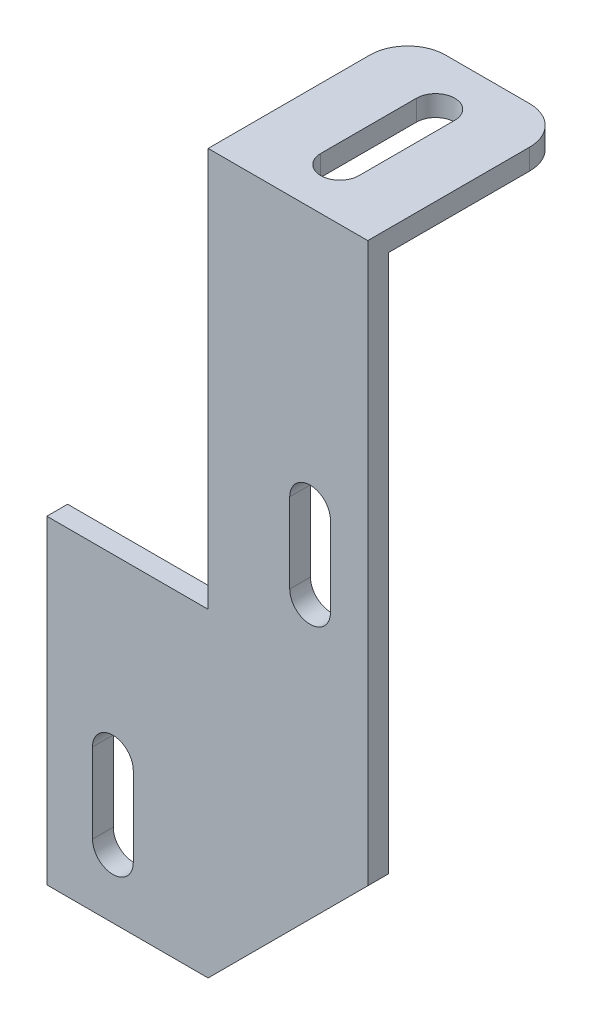
ISO-10303-21;
HEADER;
FILE_DESCRIPTION(('STEP AP214'),'2;1');
FILE_NAME('part.step','',(''),(''),'','','');
FILE_SCHEMA(('AUTOMOTIVE_DESIGN { 1 0 10303 214 1 1 1 1 }'));
ENDSEC;
DATA;
#1=APPLICATION_CONTEXT('core data for automotive mechanical design processes');
#2=APPLICATION_PROTOCOL_DEFINITION('international standard','automotive_design',2000,#1);
#3=PRODUCT_CONTEXT('',#1,'mechanical');
#4=PRODUCT('Part','Part','',(#3));
#5=PRODUCT_RELATED_PRODUCT_CATEGORY('part','',(#4));
#6=PRODUCT_DEFINITION_FORMATION('','',#4);
#7=PRODUCT_DEFINITION_CONTEXT('part definition',#1,'design');
#8=PRODUCT_DEFINITION('design','',#6,#7);
#9=PRODUCT_DEFINITION_SHAPE('','',#8);
#10=(LENGTH_UNIT() NAMED_UNIT(*) SI_UNIT(.MILLI.,.METRE.));
#11=(NAMED_UNIT(*) PLANE_ANGLE_UNIT() SI_UNIT($,.RADIAN.));
#12=(NAMED_UNIT(*) SI_UNIT($,.STERADIAN.) SOLID_ANGLE_UNIT());
#13=UNCERTAINTY_MEASURE_WITH_UNIT(LENGTH_MEASURE(1.E-05),#10,'distance_accuracy_value','');
#14=(GEOMETRIC_REPRESENTATION_CONTEXT(3) GLOBAL_UNCERTAINTY_ASSIGNED_CONTEXT((#13)) GLOBAL_UNIT_ASSIGNED_CONTEXT((#10,
#11,#12)) REPRESENTATION_CONTEXT('',''));
#15=CARTESIAN_POINT('',(0.,0.,0.));
#16=DIRECTION('',(0.,0.,1.));
#17=DIRECTION('',(1.,0.,0.));
#18=AXIS2_PLACEMENT_3D('',#15,#16,#17);
#19=CARTESIAN_POINT('',(186.43752043594,388.239,-24.9210704167667));
#20=DIRECTION('',(0.,1.,0.));
#21=DIRECTION('',(0.,0.,1.));
#22=AXIS2_PLACEMENT_3D('',#19,#20,#21);
#23=CYLINDRICAL_SURFACE('',#22,3.);
#24=CARTESIAN_POINT('',(186.43752043594,389.89,-24.9210704167667));
#25=DIRECTION('',(0.,1.,0.));
#26=DIRECTION('',(0.,0.,1.));
#27=AXIS2_PLACEMENT_3D('',#24,#25,#26);
#28=CIRCLE('',#27,3.);
#29=CARTESIAN_POINT('',(183.43752043594,389.89,-24.9210704167667));
#30=VERTEX_POINT('',#29);
#31=CARTESIAN_POINT('',(186.43752043594,389.89,-27.9210704167667));
#32=VERTEX_POINT('',#31);
#33=EDGE_CURVE('E345',#30,#32,#28,.F.);
#34=ORIENTED_EDGE('',*,*,#33,.T.);
#35=DIRECTION('',(0.,1.,0.));
#36=VECTOR('',#35,1.);
#37=CARTESIAN_POINT('',(186.43752043594,388.239,-27.9210704167667));
#38=LINE('',#37,#36);
#39=CARTESIAN_POINT('',(186.43752043594,388.239,-27.9210704167667));
#40=VERTEX_POINT('',#39);
#41=EDGE_CURVE('E250',#32,#40,#38,.F.);
#42=ORIENTED_EDGE('',*,*,#41,.T.);
#43=CARTESIAN_POINT('',(186.43752043594,388.239,-24.9210704167667));
#44=DIRECTION('',(0.,1.,0.));
#45=DIRECTION('',(0.,0.,1.));
#46=AXIS2_PLACEMENT_3D('',#43,#44,#45);
#47=CIRCLE('',#46,3.);
#48=CARTESIAN_POINT('',(183.43752043594,388.239,-24.9210704167667));
#49=VERTEX_POINT('',#48);
#50=EDGE_CURVE('E231',#49,#40,#47,.F.);
#51=ORIENTED_EDGE('',*,*,#50,.F.);
#52=DIRECTION('',(0.,1.,0.));
#53=VECTOR('',#52,1.);
#54=CARTESIAN_POINT('',(183.43752043594,388.239,-24.9210704167667));
#55=LINE('',#54,#53);
#56=EDGE_CURVE('E253',#49,#30,#55,.T.);
#57=ORIENTED_EDGE('',*,*,#56,.T.);
#58=EDGE_LOOP('',(#34,#42,#51,#57));
#59=FACE_BOUND('',#58,.T.);
#60=ADVANCED_FACE('F18',(#59),#23,.T.);
#61=CARTESIAN_POINT('',(196.13752043594,388.239,-27.9210704167667));
#62=DIRECTION('',(0.,0.,1.));
#63=DIRECTION('',(1.,0.,0.));
#64=AXIS2_PLACEMENT_3D('',#61,#62,#63);
#65=PLANE('',#64);
#66=DIRECTION('',(0.,1.,0.));
#67=VECTOR('',#66,1.);
#68=CARTESIAN_POINT('',(193.13752043594,388.239,-27.9210704167667));
#69=LINE('',#68,#67);
#70=CARTESIAN_POINT('',(193.13752043594,388.239,-27.9210704167667));
#71=VERTEX_POINT('',#70);
#72=CARTESIAN_POINT('',(193.13752043594,389.89,-27.9210704167667));
#73=VERTEX_POINT('',#72);
#74=EDGE_CURVE('E248',#71,#73,#69,.T.);
#75=ORIENTED_EDGE('',*,*,#74,.F.);
#76=DIRECTION('',(1.,0.,0.));
#77=VECTOR('',#76,1.);
#78=CARTESIAN_POINT('',(0.,388.239,-27.9210704167667));
#79=LINE('',#78,#77);
#80=EDGE_CURVE('E195',#40,#71,#79,.T.);
#81=ORIENTED_EDGE('',*,*,#80,.F.);
#82=ORIENTED_EDGE('',*,*,#41,.F.);
#83=DIRECTION('',(1.,0.,0.));
#84=VECTOR('',#83,1.);
#85=CARTESIAN_POINT('',(0.,389.89,-27.9210704167667));
#86=LINE('',#85,#84);
#87=EDGE_CURVE('E344',#32,#73,#86,.T.);
#88=ORIENTED_EDGE('',*,*,#87,.T.);
#89=EDGE_LOOP('',(#75,#81,#82,#88));
#90=FACE_BOUND('',#89,.T.);
#91=ADVANCED_FACE('F366',(#90),#65,.F.);
#92=CARTESIAN_POINT('',(193.13752043594,388.239,-24.9210704167667));
#93=DIRECTION('',(0.,1.,0.));
#94=DIRECTION('',(0.,0.,1.));
#95=AXIS2_PLACEMENT_3D('',#92,#93,#94);
#96=CYLINDRICAL_SURFACE('',#95,3.);
#97=CARTESIAN_POINT('',(193.13752043594,389.89,-24.9210704167667));
#98=DIRECTION('',(0.,1.,0.));
#99=DIRECTION('',(0.,0.,1.));
#100=AXIS2_PLACEMENT_3D('',#97,#98,#99);
#101=CIRCLE('',#100,3.);
#102=CARTESIAN_POINT('',(196.13752043594,389.89,-24.9210704167667));
#103=VERTEX_POINT('',#102);
#104=EDGE_CURVE('E341',#73,#103,#101,.F.);
#105=ORIENTED_EDGE('',*,*,#104,.T.);
#106=DIRECTION('',(0.,1.,0.));
#107=VECTOR('',#106,1.);
#108=CARTESIAN_POINT('',(196.13752043594,388.239,-24.9210704167667));
#109=LINE('',#108,#107);
#110=CARTESIAN_POINT('',(196.13752043594,388.239,-24.9210704167667));
#111=VERTEX_POINT('',#110);
#112=EDGE_CURVE('E188',#103,#111,#109,.F.);
#113=ORIENTED_EDGE('',*,*,#112,.T.);
#114=CARTESIAN_POINT('',(193.13752043594,388.239,-24.9210704167667));
#115=DIRECTION('',(0.,1.,0.));
#116=DIRECTION('',(0.,0.,1.));
#117=AXIS2_PLACEMENT_3D('',#114,#115,#116);
#118=CIRCLE('',#117,3.);
#119=EDGE_CURVE('E357',#71,#111,#118,.F.);
#120=ORIENTED_EDGE('',*,*,#119,.F.);
#121=ORIENTED_EDGE('',*,*,#74,.T.);
#122=EDGE_LOOP('',(#105,#113,#120,#121));
#123=FACE_BOUND('',#122,.T.);
#124=ADVANCED_FACE('F370',(#123),#96,.T.);
#125=CARTESIAN_POINT('',(189.78752043594,394.97,-16.1735704167667));
#126=DIRECTION('',(0.,-1.,0.));
#127=DIRECTION('',(0.,0.,-1.));
#128=AXIS2_PLACEMENT_3D('',#125,#126,#127);
#129=CYLINDRICAL_SURFACE('',#128,1.524);
#130=CARTESIAN_POINT('',(189.78752043594,388.239,-16.1735704167667));
#131=DIRECTION('',(0.,-1.,0.));
#132=DIRECTION('',(0.,0.,-1.));
#133=AXIS2_PLACEMENT_3D('',#130,#131,#132);
#134=CIRCLE('',#133,1.524);
#135=CARTESIAN_POINT('',(188.26352043594,388.239,-16.1735704167667));
#136=VERTEX_POINT('',#135);
#137=CARTESIAN_POINT('',(191.31152043594,388.239,-16.1735704167667));
#138=VERTEX_POINT('',#137);
#139=EDGE_CURVE('E21',#136,#138,#134,.F.);
#140=ORIENTED_EDGE('',*,*,#139,.F.);
#141=DIRECTION('',(0.,1.,0.));
#142=VECTOR('',#141,1.);
#143=CARTESIAN_POINT('',(188.26352043594,394.97,-16.1735704167667));
#144=LINE('',#143,#142);
#145=CARTESIAN_POINT('',(188.26352043594,389.89,-16.1735704167667));
#146=VERTEX_POINT('',#145);
#147=EDGE_CURVE('E200',#136,#146,#144,.T.);
#148=ORIENTED_EDGE('',*,*,#147,.T.);
#149=CARTESIAN_POINT('',(189.78752043594,389.89,-16.1735704167667));
#150=DIRECTION('',(0.,-1.,0.));
#151=DIRECTION('',(0.,0.,-1.));
#152=AXIS2_PLACEMENT_3D('',#149,#150,#151);
#153=CIRCLE('',#152,1.524);
#154=CARTESIAN_POINT('',(191.31152043594,389.89,-16.1735704167667));
#155=VERTEX_POINT('',#154);
#156=EDGE_CURVE('E183',#146,#155,#153,.F.);
#157=ORIENTED_EDGE('',*,*,#156,.T.);
#158=DIRECTION('',(0.,1.,0.));
#159=VECTOR('',#158,1.);
#160=CARTESIAN_POINT('',(191.31152043594,394.97,-16.1735704167667));
#161=LINE('',#160,#159);
#162=EDGE_CURVE('E181',#155,#138,#161,.F.);
#163=ORIENTED_EDGE('',*,*,#162,.T.);
#164=EDGE_LOOP('',(#140,#148,#157,#163));
#165=FACE_BOUND('',#164,.T.);
#166=ADVANCED_FACE('F182',(#165),#129,.F.);
#167=CARTESIAN_POINT('',(191.31152043594,394.97,-23.7935704167667));
#168=DIRECTION('',(1.,0.,0.));
#169=DIRECTION('',(0.,0.,-1.));
#170=AXIS2_PLACEMENT_3D('',#167,#168,#169);
#171=PLANE('',#170);
#172=DIRECTION('',(0.,0.,-1.));
#173=VECTOR('',#172,1.);
#174=CARTESIAN_POINT('',(191.31152043594,388.239,0.));
#175=LINE('',#174,#173);
#176=CARTESIAN_POINT('',(191.31152043594,388.239,-23.7935704167667));
#177=VERTEX_POINT('',#176);
#178=EDGE_CURVE('E174',#138,#177,#175,.T.);
#179=ORIENTED_EDGE('',*,*,#178,.F.);
#180=ORIENTED_EDGE('',*,*,#162,.F.);
#181=DIRECTION('',(0.,0.,-1.));
#182=VECTOR('',#181,1.);
#183=CARTESIAN_POINT('',(191.31152043594,389.89,0.));
#184=LINE('',#183,#182);
#185=CARTESIAN_POINT('',(191.31152043594,389.89,-23.7935704167667));
#186=VERTEX_POINT('',#185);
#187=EDGE_CURVE('E339',#155,#186,#184,.T.);
#188=ORIENTED_EDGE('',*,*,#187,.T.);
#189=DIRECTION('',(0.,-1.,0.));
#190=VECTOR('',#189,1.);
#191=CARTESIAN_POINT('',(191.31152043594,394.97,-23.7935704167667));
#192=LINE('',#191,#190);
#193=EDGE_CURVE('E187',#186,#177,#192,.T.);
#194=ORIENTED_EDGE('',*,*,#193,.T.);
#195=EDGE_LOOP('',(#179,#180,#188,#194));
#196=FACE_BOUND('',#195,.T.);
#197=ADVANCED_FACE('F190',(#196),#171,.F.);
#198=CARTESIAN_POINT('',(189.78752043594,394.97,-23.7935704167667));
#199=DIRECTION('',(0.,-1.,0.));
#200=DIRECTION('',(0.,0.,-1.));
#201=AXIS2_PLACEMENT_3D('',#198,#199,#200);
#202=CYLINDRICAL_SURFACE('',#201,1.524);
#203=CARTESIAN_POINT('',(189.78752043594,389.89,-23.7935704167667));
#204=DIRECTION('',(0.,-1.,0.));
#205=DIRECTION('',(0.,0.,-1.));
#206=AXIS2_PLACEMENT_3D('',#203,#204,#205);
#207=CIRCLE('',#206,1.524);
#208=CARTESIAN_POINT('',(188.26352043594,389.89,-23.7935704167667));
#209=VERTEX_POINT('',#208);
#210=EDGE_CURVE('E336',#186,#209,#207,.F.);
#211=ORIENTED_EDGE('',*,*,#210,.T.);
#212=DIRECTION('',(0.,1.,0.));
#213=VECTOR('',#212,1.);
#214=CARTESIAN_POINT('',(188.26352043594,394.97,-23.7935704167667));
#215=LINE('',#214,#213);
#216=CARTESIAN_POINT('',(188.26352043594,388.239,-23.7935704167667));
#217=VERTEX_POINT('',#216);
#218=EDGE_CURVE('E243',#209,#217,#215,.F.);
#219=ORIENTED_EDGE('',*,*,#218,.T.);
#220=CARTESIAN_POINT('',(189.78752043594,388.239,-23.7935704167667));
#221=DIRECTION('',(0.,-1.,0.));
#222=DIRECTION('',(0.,0.,-1.));
#223=AXIS2_PLACEMENT_3D('',#220,#221,#222);
#224=CIRCLE('',#223,1.524);
#225=EDGE_CURVE('E193',#177,#217,#224,.F.);
#226=ORIENTED_EDGE('',*,*,#225,.F.);
#227=ORIENTED_EDGE('',*,*,#193,.F.);
#228=EDGE_LOOP('',(#211,#219,#226,#227));
#229=FACE_BOUND('',#228,.T.);
#230=ADVANCED_FACE('F439',(#229),#202,.F.);
#231=CARTESIAN_POINT('',(188.26352043594,394.97,-23.7935704167667));
#232=DIRECTION('',(-1.,0.,0.));
#233=DIRECTION('',(0.,0.,1.));
#234=AXIS2_PLACEMENT_3D('',#231,#232,#233);
#235=PLANE('',#234);
#236=DIRECTION('',(0.,0.,-1.));
#237=VECTOR('',#236,1.);
#238=CARTESIAN_POINT('',(188.26352043594,388.239,0.));
#239=LINE('',#238,#237);
#240=EDGE_CURVE('E177',#217,#136,#239,.F.);
#241=ORIENTED_EDGE('',*,*,#240,.F.);
#242=ORIENTED_EDGE('',*,*,#218,.F.);
#243=DIRECTION('',(0.,0.,-1.));
#244=VECTOR('',#243,1.);
#245=CARTESIAN_POINT('',(188.26352043594,389.89,0.));
#246=LINE('',#245,#244);
#247=EDGE_CURVE('E210',#209,#146,#246,.F.);
#248=ORIENTED_EDGE('',*,*,#247,.T.);
#249=ORIENTED_EDGE('',*,*,#147,.F.);
#250=EDGE_LOOP('',(#241,#242,#248,#249));
#251=FACE_BOUND('',#250,.T.);
#252=ADVANCED_FACE('F441',(#251),#235,.F.);
#253=CARTESIAN_POINT('',(0.,388.239,0.));
#254=DIRECTION('',(0.,-1.,0.));
#255=DIRECTION('',(0.,0.,-1.));
#256=AXIS2_PLACEMENT_3D('',#253,#254,#255);
#257=PLANE('',#256);
#258=DIRECTION('',(0.,0.,-1.));
#259=VECTOR('',#258,1.);
#260=CARTESIAN_POINT('',(183.43752043594,388.239,-27.9210704167667));
#261=LINE('',#260,#259);
#262=CARTESIAN_POINT('',(183.43752043594,388.239,-13.6970704167667));
#263=VERTEX_POINT('',#262);
#264=EDGE_CURVE('E256',#263,#49,#261,.T.);
#265=ORIENTED_EDGE('',*,*,#264,.T.);
#266=ORIENTED_EDGE('',*,*,#50,.T.);
#267=ORIENTED_EDGE('',*,*,#80,.T.);
#268=ORIENTED_EDGE('',*,*,#119,.T.);
#269=DIRECTION('',(0.,0.,1.));
#270=VECTOR('',#269,1.);
#271=CARTESIAN_POINT('',(196.13752043594,388.239,-27.9210704167667));
#272=LINE('',#271,#270);
#273=CARTESIAN_POINT('',(196.13752043594,388.239,-13.6970704167667));
#274=VERTEX_POINT('',#273);
#275=EDGE_CURVE('E201',#111,#274,#272,.T.);
#276=ORIENTED_EDGE('',*,*,#275,.T.);
#277=DIRECTION('',(1.,0.,0.));
#278=VECTOR('',#277,1.);
#279=CARTESIAN_POINT('',(0.,388.239,-13.6970704167667));
#280=LINE('',#279,#278);
#281=EDGE_CURVE('E228',#274,#263,#280,.F.);
#282=ORIENTED_EDGE('',*,*,#281,.T.);
#283=EDGE_LOOP('',(#265,#266,#267,#268,#276,#282));
#284=FACE_BOUND('',#283,.T.);
#285=ORIENTED_EDGE('',*,*,#178,.T.);
#286=ORIENTED_EDGE('',*,*,#225,.T.);
#287=ORIENTED_EDGE('',*,*,#240,.T.);
#288=ORIENTED_EDGE('',*,*,#139,.T.);
#289=EDGE_LOOP('',(#285,#286,#287,#288));
#290=FACE_BOUND('',#289,.T.);
#291=ADVANCED_FACE('F171',(#284,#290),#257,.T.);
#292=CARTESIAN_POINT('',(0.,0.,-13.6970704167667));
#293=DIRECTION('',(0.,0.,1.));
#294=DIRECTION('',(1.,0.,0.));
#295=AXIS2_PLACEMENT_3D('',#292,#293,#294);
#296=PLANE('',#295);
#297=DIRECTION('',(-0.707106781186546,-0.707106781186549,0.));
#298=VECTOR('',#297,1.);
#299=CARTESIAN_POINT('',(183.43752043594,332.74,-13.6970704167667));
#300=LINE('',#299,#298);
#301=CARTESIAN_POINT('',(196.13752043594,345.44,-13.6970704167667));
#302=VERTEX_POINT('',#301);
#303=CARTESIAN_POINT('',(183.43752043594,332.74,-13.6970704167667));
#304=VERTEX_POINT('',#303);
#305=EDGE_CURVE('E234',#302,#304,#300,.T.);
#306=ORIENTED_EDGE('',*,*,#305,.T.);
#307=DIRECTION('',(1.,0.,0.));
#308=VECTOR('',#307,1.);
#309=CARTESIAN_POINT('',(183.43752043594,332.74,-13.6970704167667));
#310=LINE('',#309,#308);
#311=CARTESIAN_POINT('',(170.61052043594,332.74,-13.6970704167667));
#312=VERTEX_POINT('',#311);
#313=EDGE_CURVE('E298',#304,#312,#310,.F.);
#314=ORIENTED_EDGE('',*,*,#313,.T.);
#315=DIRECTION('',(0.,1.,0.));
#316=VECTOR('',#315,1.);
#317=CARTESIAN_POINT('',(170.61052043594,332.74,-13.6970704167667));
#318=LINE('',#317,#316);
#319=CARTESIAN_POINT('',(170.61052043594,358.14,-13.6970704167667));
#320=VERTEX_POINT('',#319);
#321=EDGE_CURVE('E279',#320,#312,#318,.F.);
#322=ORIENTED_EDGE('',*,*,#321,.F.);
#323=DIRECTION('',(1.,0.,0.));
#324=VECTOR('',#323,1.);
#325=CARTESIAN_POINT('',(183.43752043594,358.14,-13.6970704167667));
#326=LINE('',#325,#324);
#327=CARTESIAN_POINT('',(183.43752043594,358.14,-13.6970704167667));
#328=VERTEX_POINT('',#327);
#329=EDGE_CURVE('E277',#328,#320,#326,.F.);
#330=ORIENTED_EDGE('',*,*,#329,.F.);
#331=DIRECTION('',(0.,1.,0.));
#332=VECTOR('',#331,1.);
#333=CARTESIAN_POINT('',(183.43752043594,388.239,-13.6970704167667));
#334=LINE('',#333,#332);
#335=EDGE_CURVE('E264',#328,#263,#334,.T.);
#336=ORIENTED_EDGE('',*,*,#335,.T.);
#337=ORIENTED_EDGE('',*,*,#281,.F.);
#338=DIRECTION('',(0.,1.,0.));
#339=VECTOR('',#338,1.);
#340=CARTESIAN_POINT('',(196.13752043594,388.239,-13.6970704167667));
#341=LINE('',#340,#339);
#342=EDGE_CURVE('E208',#274,#302,#341,.F.);
#343=ORIENTED_EDGE('',*,*,#342,.T.);
#344=EDGE_LOOP('',(#306,#314,#322,#330,#336,#337,#343));
#345=FACE_BOUND('',#344,.T.);
#346=CARTESIAN_POINT('',(191.550250383083,369.134894710635,-13.6970704167667));
#347=DIRECTION('',(0.,0.,-1.));
#348=DIRECTION('',(-1.,0.,0.));
#349=AXIS2_PLACEMENT_3D('',#346,#347,#348);
#350=CIRCLE('',#349,1.62099013813655);
#351=CARTESIAN_POINT('',(193.17124052122,369.134894710635,-13.6970704167667));
#352=VERTEX_POINT('',#351);
#353=CARTESIAN_POINT('',(189.929260244947,369.134894710635,-13.6970704167667));
#354=VERTEX_POINT('',#353);
#355=EDGE_CURVE('E348',#352,#354,#350,.F.);
#356=ORIENTED_EDGE('',*,*,#355,.T.);
#357=DIRECTION('',(0.,1.,0.));
#358=VECTOR('',#357,1.);
#359=CARTESIAN_POINT('',(189.929260244947,369.134894710635,-13.6970704167667));
#360=LINE('',#359,#358);
#361=CARTESIAN_POINT('',(189.929260244947,362.784894710635,-13.6970704167667));
#362=VERTEX_POINT('',#361);
#363=EDGE_CURVE('E304',#354,#362,#360,.F.);
#364=ORIENTED_EDGE('',*,*,#363,.T.);
#365=CARTESIAN_POINT('',(191.550250383083,362.784894710635,-13.6970704167667));
#366=DIRECTION('',(0.,0.,-1.));
#367=DIRECTION('',(-1.,0.,0.));
#368=AXIS2_PLACEMENT_3D('',#365,#366,#367);
#369=CIRCLE('',#368,1.62099013813655);
#370=CARTESIAN_POINT('',(193.17124052122,362.784894710635,-13.6970704167667));
#371=VERTEX_POINT('',#370);
#372=EDGE_CURVE('E350',#362,#371,#369,.F.);
#373=ORIENTED_EDGE('',*,*,#372,.T.);
#374=DIRECTION('',(0.,1.,0.));
#375=VECTOR('',#374,1.);
#376=CARTESIAN_POINT('',(193.17124052122,369.134894710635,-13.6970704167667));
#377=LINE('',#376,#375);
#378=EDGE_CURVE('E308',#371,#352,#377,.T.);
#379=ORIENTED_EDGE('',*,*,#378,.T.);
#380=EDGE_LOOP('',(#356,#364,#373,#379));
#381=FACE_BOUND('',#380,.T.);
#382=CARTESIAN_POINT('',(175.863160430472,344.058028591819,-13.6970704167667));
#383=DIRECTION('',(0.,0.,-1.));
#384=DIRECTION('',(-1.,0.,0.));
#385=AXIS2_PLACEMENT_3D('',#382,#383,#384);
#386=CIRCLE('',#385,1.62099013813657);
#387=CARTESIAN_POINT('',(177.484150568608,344.058028591819,-13.6970704167667));
#388=VERTEX_POINT('',#387);
#389=CARTESIAN_POINT('',(174.242170292335,344.058028591819,-13.6970704167667));
#390=VERTEX_POINT('',#389);
#391=EDGE_CURVE('E352',#388,#390,#386,.F.);
#392=ORIENTED_EDGE('',*,*,#391,.T.);
#393=DIRECTION('',(0.,1.,0.));
#394=VECTOR('',#393,1.);
#395=CARTESIAN_POINT('',(174.242170292335,344.058028591819,-13.6970704167667));
#396=LINE('',#395,#394);
#397=CARTESIAN_POINT('',(174.242170292335,337.708028591819,-13.6970704167667));
#398=VERTEX_POINT('',#397);
#399=EDGE_CURVE('E312',#390,#398,#396,.F.);
#400=ORIENTED_EDGE('',*,*,#399,.T.);
#401=CARTESIAN_POINT('',(175.863160430472,337.708028591819,-13.6970704167667));
#402=DIRECTION('',(0.,0.,-1.));
#403=DIRECTION('',(-1.,0.,0.));
#404=AXIS2_PLACEMENT_3D('',#401,#402,#403);
#405=CIRCLE('',#404,1.62099013813657);
#406=CARTESIAN_POINT('',(177.484150568608,337.708028591819,-13.6970704167667));
#407=VERTEX_POINT('',#406);
#408=EDGE_CURVE('E230',#398,#407,#405,.F.);
#409=ORIENTED_EDGE('',*,*,#408,.T.);
#410=DIRECTION('',(0.,1.,0.));
#411=VECTOR('',#410,1.);
#412=CARTESIAN_POINT('',(177.484150568608,344.058028591819,-13.6970704167667));
#413=LINE('',#412,#411);
#414=EDGE_CURVE('E317',#407,#388,#413,.T.);
#415=ORIENTED_EDGE('',*,*,#414,.T.);
#416=EDGE_LOOP('',(#392,#400,#409,#415));
#417=FACE_BOUND('',#416,.T.);
#418=ADVANCED_FACE('F382',(#345,#381,#417),#296,.F.);
#419=CARTESIAN_POINT('',(175.863160430472,337.708028591819,2.65292958323325));
#420=DIRECTION('',(0.,0.,-1.));
#421=DIRECTION('',(-1.,0.,0.));
#422=AXIS2_PLACEMENT_3D('',#419,#420,#421);
#423=CYLINDRICAL_SURFACE('',#422,1.62099013813657);
#424=ORIENTED_EDGE('',*,*,#408,.F.);
#425=DIRECTION('',(0.,0.,1.));
#426=VECTOR('',#425,1.);
#427=CARTESIAN_POINT('',(174.242170292335,337.708028591819,2.65292958323325));
#428=LINE('',#427,#426);
#429=CARTESIAN_POINT('',(174.242170292335,337.708028591819,-12.0460704167667));
#430=VERTEX_POINT('',#429);
#431=EDGE_CURVE('E315',#398,#430,#428,.T.);
#432=ORIENTED_EDGE('',*,*,#431,.T.);
#433=CARTESIAN_POINT('',(175.863160430472,337.708028591819,-12.0460704167667));
#434=DIRECTION('',(0.,0.,-1.));
#435=DIRECTION('',(-1.,0.,0.));
#436=AXIS2_PLACEMENT_3D('',#433,#434,#435);
#437=CIRCLE('',#436,1.62099013813657);
#438=CARTESIAN_POINT('',(177.484150568608,337.708028591819,-12.0460704167667));
#439=VERTEX_POINT('',#438);
#440=EDGE_CURVE('E301',#430,#439,#437,.F.);
#441=ORIENTED_EDGE('',*,*,#440,.T.);
#442=DIRECTION('',(0.,0.,-1.));
#443=VECTOR('',#442,1.);
#444=CARTESIAN_POINT('',(177.484150568608,337.708028591819,2.65292958323325));
#445=LINE('',#444,#443);
#446=EDGE_CURVE('E320',#439,#407,#445,.T.);
#447=ORIENTED_EDGE('',*,*,#446,.T.);
#448=EDGE_LOOP('',(#424,#432,#441,#447));
#449=FACE_BOUND('',#448,.T.);
#450=ADVANCED_FACE('F420',(#449),#423,.F.);
#451=CARTESIAN_POINT('',(177.484150568608,344.058028591819,2.65292958323325));
#452=DIRECTION('',(1.,0.,0.));
#453=DIRECTION('',(0.,0.,-1.));
#454=AXIS2_PLACEMENT_3D('',#451,#452,#453);
#455=PLANE('',#454);
#456=ORIENTED_EDGE('',*,*,#414,.F.);
#457=ORIENTED_EDGE('',*,*,#446,.F.);
#458=DIRECTION('',(0.,1.,0.));
#459=VECTOR('',#458,1.);
#460=CARTESIAN_POINT('',(177.484150568608,388.239,-12.0460704167667));
#461=LINE('',#460,#459);
#462=CARTESIAN_POINT('',(177.484150568608,344.058028591819,-12.0460704167667));
#463=VERTEX_POINT('',#462);
#464=EDGE_CURVE('E333',#439,#463,#461,.T.);
#465=ORIENTED_EDGE('',*,*,#464,.T.);
#466=DIRECTION('',(0.,0.,-1.));
#467=VECTOR('',#466,1.);
#468=CARTESIAN_POINT('',(177.484150568608,344.058028591819,2.65292958323325));
#469=LINE('',#468,#467);
#470=EDGE_CURVE('E319',#463,#388,#469,.T.);
#471=ORIENTED_EDGE('',*,*,#470,.T.);
#472=EDGE_LOOP('',(#456,#457,#465,#471));
#473=FACE_BOUND('',#472,.T.);
#474=ADVANCED_FACE('F426',(#473),#455,.F.);
#475=CARTESIAN_POINT('',(175.863160430472,344.058028591819,2.65292958323325));
#476=DIRECTION('',(0.,0.,-1.));
#477=DIRECTION('',(-1.,0.,0.));
#478=AXIS2_PLACEMENT_3D('',#475,#476,#477);
#479=CYLINDRICAL_SURFACE('',#478,1.62099013813657);
#480=ORIENTED_EDGE('',*,*,#391,.F.);
#481=ORIENTED_EDGE('',*,*,#470,.F.);
#482=CARTESIAN_POINT('',(175.863160430472,344.058028591819,-12.0460704167667));
#483=DIRECTION('',(0.,0.,-1.));
#484=DIRECTION('',(-1.,0.,0.));
#485=AXIS2_PLACEMENT_3D('',#482,#483,#484);
#486=CIRCLE('',#485,1.62099013813657);
#487=CARTESIAN_POINT('',(174.242170292335,344.058028591819,-12.0460704167667));
#488=VERTEX_POINT('',#487);
#489=EDGE_CURVE('E330',#463,#488,#486,.F.);
#490=ORIENTED_EDGE('',*,*,#489,.T.);
#491=DIRECTION('',(0.,0.,1.));
#492=VECTOR('',#491,1.);
#493=CARTESIAN_POINT('',(174.242170292335,344.058028591819,2.65292958323325));
#494=LINE('',#493,#492);
#495=EDGE_CURVE('E316',#488,#390,#494,.F.);
#496=ORIENTED_EDGE('',*,*,#495,.T.);
#497=EDGE_LOOP('',(#480,#481,#490,#496));
#498=FACE_BOUND('',#497,.T.);
#499=ADVANCED_FACE('F494',(#498),#479,.F.);
#500=CARTESIAN_POINT('',(174.242170292335,344.058028591819,2.65292958323325));
#501=DIRECTION('',(-1.,0.,0.));
#502=DIRECTION('',(0.,0.,1.));
#503=AXIS2_PLACEMENT_3D('',#500,#501,#502);
#504=PLANE('',#503);
#505=ORIENTED_EDGE('',*,*,#399,.F.);
#506=ORIENTED_EDGE('',*,*,#495,.F.);
#507=DIRECTION('',(0.,1.,0.));
#508=VECTOR('',#507,1.);
#509=CARTESIAN_POINT('',(174.242170292335,388.239,-12.0460704167667));
#510=LINE('',#509,#508);
#511=EDGE_CURVE('E329',#488,#430,#510,.F.);
#512=ORIENTED_EDGE('',*,*,#511,.T.);
#513=ORIENTED_EDGE('',*,*,#431,.F.);
#514=EDGE_LOOP('',(#505,#506,#512,#513));
#515=FACE_BOUND('',#514,.T.);
#516=ADVANCED_FACE('F490',(#515),#504,.F.);
#517=CARTESIAN_POINT('',(191.550250383083,362.784894710635,2.65292958323325));
#518=DIRECTION('',(0.,0.,-1.));
#519=DIRECTION('',(-1.,0.,0.));
#520=AXIS2_PLACEMENT_3D('',#517,#518,#519);
#521=CYLINDRICAL_SURFACE('',#520,1.62099013813655);
#522=ORIENTED_EDGE('',*,*,#372,.F.);
#523=DIRECTION('',(0.,0.,1.));
#524=VECTOR('',#523,1.);
#525=CARTESIAN_POINT('',(189.929260244947,362.784894710635,2.65292958323325));
#526=LINE('',#525,#524);
#527=CARTESIAN_POINT('',(189.929260244947,362.784894710635,-12.0460704167667));
#528=VERTEX_POINT('',#527);
#529=EDGE_CURVE('E288',#362,#528,#526,.T.);
#530=ORIENTED_EDGE('',*,*,#529,.T.);
#531=CARTESIAN_POINT('',(191.550250383083,362.784894710635,-12.0460704167667));
#532=DIRECTION('',(0.,0.,-1.));
#533=DIRECTION('',(-1.,0.,0.));
#534=AXIS2_PLACEMENT_3D('',#531,#532,#533);
#535=CIRCLE('',#534,1.62099013813655);
#536=CARTESIAN_POINT('',(193.17124052122,362.784894710635,-12.0460704167667));
#537=VERTEX_POINT('',#536);
#538=EDGE_CURVE('E326',#528,#537,#535,.F.);
#539=ORIENTED_EDGE('',*,*,#538,.T.);
#540=DIRECTION('',(0.,0.,-1.));
#541=VECTOR('',#540,1.);
#542=CARTESIAN_POINT('',(193.17124052122,362.784894710635,2.65292958323325));
#543=LINE('',#542,#541);
#544=EDGE_CURVE('E311',#537,#371,#543,.T.);
#545=ORIENTED_EDGE('',*,*,#544,.T.);
#546=EDGE_LOOP('',(#522,#530,#539,#545));
#547=FACE_BOUND('',#546,.T.);
#548=ADVANCED_FACE('F486',(#547),#521,.F.);
#549=CARTESIAN_POINT('',(193.17124052122,369.134894710635,2.65292958323325));
#550=DIRECTION('',(1.,0.,0.));
#551=DIRECTION('',(0.,0.,-1.));
#552=AXIS2_PLACEMENT_3D('',#549,#550,#551);
#553=PLANE('',#552);
#554=ORIENTED_EDGE('',*,*,#378,.F.);
#555=ORIENTED_EDGE('',*,*,#544,.F.);
#556=DIRECTION('',(0.,1.,0.));
#557=VECTOR('',#556,1.);
#558=CARTESIAN_POINT('',(193.17124052122,388.239,-12.0460704167667));
#559=LINE('',#558,#557);
#560=CARTESIAN_POINT('',(193.17124052122,369.134894710635,-12.0460704167667));
#561=VERTEX_POINT('',#560);
#562=EDGE_CURVE('E325',#537,#561,#559,.T.);
#563=ORIENTED_EDGE('',*,*,#562,.T.);
#564=DIRECTION('',(0.,0.,-1.));
#565=VECTOR('',#564,1.);
#566=CARTESIAN_POINT('',(193.17124052122,369.134894710635,2.65292958323325));
#567=LINE('',#566,#565);
#568=EDGE_CURVE('E310',#561,#352,#567,.T.);
#569=ORIENTED_EDGE('',*,*,#568,.T.);
#570=EDGE_LOOP('',(#554,#555,#563,#569));
#571=FACE_BOUND('',#570,.T.);
#572=ADVANCED_FACE('F482',(#571),#553,.F.);
#573=CARTESIAN_POINT('',(191.550250383083,369.134894710635,2.65292958323325));
#574=DIRECTION('',(0.,0.,-1.));
#575=DIRECTION('',(-1.,0.,0.));
#576=AXIS2_PLACEMENT_3D('',#573,#574,#575);
#577=CYLINDRICAL_SURFACE('',#576,1.62099013813655);
#578=ORIENTED_EDGE('',*,*,#355,.F.);
#579=ORIENTED_EDGE('',*,*,#568,.F.);
#580=CARTESIAN_POINT('',(191.550250383083,369.134894710635,-12.0460704167667));
#581=DIRECTION('',(0.,0.,-1.));
#582=DIRECTION('',(-1.,0.,0.));
#583=AXIS2_PLACEMENT_3D('',#580,#581,#582);
#584=CIRCLE('',#583,1.62099013813655);
#585=CARTESIAN_POINT('',(189.929260244947,369.134894710635,-12.0460704167667));
#586=VERTEX_POINT('',#585);
#587=EDGE_CURVE('E321',#561,#586,#584,.F.);
#588=ORIENTED_EDGE('',*,*,#587,.T.);
#589=DIRECTION('',(0.,0.,1.));
#590=VECTOR('',#589,1.);
#591=CARTESIAN_POINT('',(189.929260244947,369.134894710635,2.65292958323325));
#592=LINE('',#591,#590);
#593=EDGE_CURVE('E307',#586,#354,#592,.F.);
#594=ORIENTED_EDGE('',*,*,#593,.T.);
#595=EDGE_LOOP('',(#578,#579,#588,#594));
#596=FACE_BOUND('',#595,.T.);
#597=ADVANCED_FACE('F478',(#596),#577,.F.);
#598=CARTESIAN_POINT('',(189.929260244947,369.134894710635,2.65292958323325));
#599=DIRECTION('',(-1.,0.,0.));
#600=DIRECTION('',(0.,0.,1.));
#601=AXIS2_PLACEMENT_3D('',#598,#599,#600);
#602=PLANE('',#601);
#603=ORIENTED_EDGE('',*,*,#363,.F.);
#604=ORIENTED_EDGE('',*,*,#593,.F.);
#605=DIRECTION('',(0.,1.,0.));
#606=VECTOR('',#605,1.);
#607=CARTESIAN_POINT('',(189.929260244947,388.239,-12.0460704167667));
#608=LINE('',#607,#606);
#609=EDGE_CURVE('E324',#586,#528,#608,.F.);
#610=ORIENTED_EDGE('',*,*,#609,.T.);
#611=ORIENTED_EDGE('',*,*,#529,.F.);
#612=EDGE_LOOP('',(#603,#604,#610,#611));
#613=FACE_BOUND('',#612,.T.);
#614=ADVANCED_FACE('F474',(#613),#602,.F.);
#615=CARTESIAN_POINT('',(170.61052043594,332.74,-12.0460704167668));
#616=DIRECTION('',(-1.,0.,0.));
#617=DIRECTION('',(0.,0.,1.));
#618=AXIS2_PLACEMENT_3D('',#615,#616,#617);
#619=PLANE('',#618);
#620=DIRECTION('',(0.,1.,0.));
#621=VECTOR('',#620,1.);
#622=CARTESIAN_POINT('',(170.61052043594,388.239,-12.0460704167667));
#623=LINE('',#622,#621);
#624=CARTESIAN_POINT('',(170.61052043594,332.74,-12.0460704167667));
#625=VERTEX_POINT('',#624);
#626=CARTESIAN_POINT('',(170.61052043594,358.14,-12.0460704167667));
#627=VERTEX_POINT('',#626);
#628=EDGE_CURVE('E284',#625,#627,#623,.T.);
#629=ORIENTED_EDGE('',*,*,#628,.T.);
#630=DIRECTION('',(0.,0.,1.));
#631=VECTOR('',#630,1.);
#632=CARTESIAN_POINT('',(170.61052043594,358.14,-12.0460704167668));
#633=LINE('',#632,#631);
#634=EDGE_CURVE('E274',#320,#627,#633,.T.);
#635=ORIENTED_EDGE('',*,*,#634,.F.);
#636=ORIENTED_EDGE('',*,*,#321,.T.);
#637=DIRECTION('',(0.,0.,1.));
#638=VECTOR('',#637,1.);
#639=CARTESIAN_POINT('',(170.61052043594,332.74,-13.6970704167667));
#640=LINE('',#639,#638);
#641=EDGE_CURVE('E236',#312,#625,#640,.T.);
#642=ORIENTED_EDGE('',*,*,#641,.T.);
#643=EDGE_LOOP('',(#629,#635,#636,#642));
#644=FACE_BOUND('',#643,.T.);
#645=ADVANCED_FACE('F471',(#644),#619,.T.);
#646=CARTESIAN_POINT('',(183.43752043594,358.14,-12.0460704167668));
#647=DIRECTION('',(0.,1.,0.));
#648=DIRECTION('',(0.,0.,1.));
#649=AXIS2_PLACEMENT_3D('',#646,#647,#648);
#650=PLANE('',#649);
#651=DIRECTION('',(-1.,0.,0.));
#652=VECTOR('',#651,1.);
#653=CARTESIAN_POINT('',(196.13752043594,358.14,-12.0460704167667));
#654=LINE('',#653,#652);
#655=CARTESIAN_POINT('',(183.43752043594,358.14,-12.0460704167667));
#656=VERTEX_POINT('',#655);
#657=EDGE_CURVE('E259',#627,#656,#654,.F.);
#658=ORIENTED_EDGE('',*,*,#657,.T.);
#659=DIRECTION('',(0.,0.,-1.));
#660=VECTOR('',#659,1.);
#661=CARTESIAN_POINT('',(183.43752043594,358.14,-27.9210704167667));
#662=LINE('',#661,#660);
#663=EDGE_CURVE('E269',#656,#328,#662,.T.);
#664=ORIENTED_EDGE('',*,*,#663,.T.);
#665=ORIENTED_EDGE('',*,*,#329,.T.);
#666=ORIENTED_EDGE('',*,*,#634,.T.);
#667=EDGE_LOOP('',(#658,#664,#665,#666));
#668=FACE_BOUND('',#667,.T.);
#669=ADVANCED_FACE('F387',(#668),#650,.T.);
#670=CARTESIAN_POINT('',(183.43752043594,388.239,-27.9210704167667));
#671=DIRECTION('',(1.,0.,0.));
#672=DIRECTION('',(0.,0.,-1.));
#673=AXIS2_PLACEMENT_3D('',#670,#671,#672);
#674=PLANE('',#673);
#675=ORIENTED_EDGE('',*,*,#56,.F.);
#676=ORIENTED_EDGE('',*,*,#264,.F.);
#677=ORIENTED_EDGE('',*,*,#335,.F.);
#678=ORIENTED_EDGE('',*,*,#663,.F.);
#679=DIRECTION('',(0.,1.,0.));
#680=VECTOR('',#679,1.);
#681=CARTESIAN_POINT('',(183.43752043594,388.239,-12.0460704167667));
#682=LINE('',#681,#680);
#683=CARTESIAN_POINT('',(183.43752043594,389.89,-12.0460704167667));
#684=VERTEX_POINT('',#683);
#685=EDGE_CURVE('E225',#656,#684,#682,.T.);
#686=ORIENTED_EDGE('',*,*,#685,.T.);
#687=DIRECTION('',(0.,0.,-1.));
#688=VECTOR('',#687,1.);
#689=CARTESIAN_POINT('',(183.43752043594,389.89,0.));
#690=LINE('',#689,#688);
#691=EDGE_CURVE('E255',#684,#30,#690,.T.);
#692=ORIENTED_EDGE('',*,*,#691,.T.);
#693=EDGE_LOOP('',(#675,#676,#677,#678,#686,#692));
#694=FACE_BOUND('',#693,.T.);
#695=ADVANCED_FACE('F380',(#694),#674,.F.);
#696=CARTESIAN_POINT('',(0.,389.89,0.));
#697=DIRECTION('',(0.,-1.,0.));
#698=DIRECTION('',(0.,0.,-1.));
#699=AXIS2_PLACEMENT_3D('',#696,#697,#698);
#700=PLANE('',#699);
#701=ORIENTED_EDGE('',*,*,#210,.F.);
#702=ORIENTED_EDGE('',*,*,#187,.F.);
#703=ORIENTED_EDGE('',*,*,#156,.F.);
#704=ORIENTED_EDGE('',*,*,#247,.F.);
#705=EDGE_LOOP('',(#701,#702,#703,#704));
#706=FACE_BOUND('',#705,.T.);
#707=ORIENTED_EDGE('',*,*,#104,.F.);
#708=ORIENTED_EDGE('',*,*,#87,.F.);
#709=ORIENTED_EDGE('',*,*,#33,.F.);
#710=ORIENTED_EDGE('',*,*,#691,.F.);
#711=DIRECTION('',(-1.,0.,0.));
#712=VECTOR('',#711,1.);
#713=CARTESIAN_POINT('',(196.13752043594,389.89,-12.0460704167667));
#714=LINE('',#713,#712);
#715=CARTESIAN_POINT('',(196.13752043594,389.89,-12.0460704167667));
#716=VERTEX_POINT('',#715);
#717=EDGE_CURVE('E220',#684,#716,#714,.F.);
#718=ORIENTED_EDGE('',*,*,#717,.T.);
#719=DIRECTION('',(0.,0.,1.));
#720=VECTOR('',#719,1.);
#721=CARTESIAN_POINT('',(196.13752043594,389.89,-27.9210704167667));
#722=LINE('',#721,#720);
#723=EDGE_CURVE('E205',#716,#103,#722,.F.);
#724=ORIENTED_EDGE('',*,*,#723,.T.);
#725=EDGE_LOOP('',(#707,#708,#709,#710,#718,#724));
#726=FACE_BOUND('',#725,.T.);
#727=ADVANCED_FACE('F397',(#706,#726),#700,.F.);
#728=CARTESIAN_POINT('',(196.13752043594,388.239,-27.9210704167667));
#729=DIRECTION('',(-1.,0.,0.));
#730=DIRECTION('',(0.,0.,1.));
#731=AXIS2_PLACEMENT_3D('',#728,#729,#730);
#732=PLANE('',#731);
#733=ORIENTED_EDGE('',*,*,#112,.F.);
#734=ORIENTED_EDGE('',*,*,#723,.F.);
#735=DIRECTION('',(0.,1.,0.));
#736=VECTOR('',#735,1.);
#737=CARTESIAN_POINT('',(196.13752043594,388.239,-12.0460704167667));
#738=LINE('',#737,#736);
#739=CARTESIAN_POINT('',(196.13752043594,345.44,-12.0460704167667));
#740=VERTEX_POINT('',#739);
#741=EDGE_CURVE('E217',#716,#740,#738,.F.);
#742=ORIENTED_EDGE('',*,*,#741,.T.);
#743=DIRECTION('',(0.,0.,1.));
#744=VECTOR('',#743,1.);
#745=CARTESIAN_POINT('',(196.13752043594,345.44,-13.6970704167667));
#746=LINE('',#745,#744);
#747=EDGE_CURVE('E204',#740,#302,#746,.F.);
#748=ORIENTED_EDGE('',*,*,#747,.T.);
#749=ORIENTED_EDGE('',*,*,#342,.F.);
#750=ORIENTED_EDGE('',*,*,#275,.F.);
#751=EDGE_LOOP('',(#733,#734,#742,#748,#749,#750));
#752=FACE_BOUND('',#751,.T.);
#753=ADVANCED_FACE('F372',(#752),#732,.F.);
#754=CARTESIAN_POINT('',(183.43752043594,332.74,-13.6970704167667));
#755=DIRECTION('',(-0.707106781186549,0.707106781186546,0.));
#756=DIRECTION('',(-0.707106781186546,-0.707106781186549,0.));
#757=AXIS2_PLACEMENT_3D('',#754,#755,#756);
#758=PLANE('',#757);
#759=ORIENTED_EDGE('',*,*,#747,.F.);
#760=DIRECTION('',(-0.707106781186546,-0.707106781186549,0.));
#761=VECTOR('',#760,1.);
#762=CARTESIAN_POINT('',(196.13752043594,345.44,-12.0460704167667));
#763=LINE('',#762,#761);
#764=CARTESIAN_POINT('',(183.43752043594,332.74,-12.0460704167667));
#765=VERTEX_POINT('',#764);
#766=EDGE_CURVE('E27',#740,#765,#763,.T.);
#767=ORIENTED_EDGE('',*,*,#766,.T.);
#768=DIRECTION('',(0.,0.,1.));
#769=VECTOR('',#768,1.);
#770=CARTESIAN_POINT('',(183.43752043594,332.74,-13.6970704167667));
#771=LINE('',#770,#769);
#772=EDGE_CURVE('E35',#765,#304,#771,.F.);
#773=ORIENTED_EDGE('',*,*,#772,.T.);
#774=ORIENTED_EDGE('',*,*,#305,.F.);
#775=EDGE_LOOP('',(#759,#767,#773,#774));
#776=FACE_BOUND('',#775,.T.);
#777=ADVANCED_FACE('F457',(#776),#758,.F.);
#778=CARTESIAN_POINT('',(183.43752043594,332.74,-13.6970704167667));
#779=DIRECTION('',(0.,1.,0.));
#780=DIRECTION('',(0.,0.,1.));
#781=AXIS2_PLACEMENT_3D('',#778,#779,#780);
#782=PLANE('',#781);
#783=ORIENTED_EDGE('',*,*,#772,.F.);
#784=DIRECTION('',(-1.,0.,0.));
#785=VECTOR('',#784,1.);
#786=CARTESIAN_POINT('',(196.13752043594,332.74,-12.0460704167667));
#787=LINE('',#786,#785);
#788=EDGE_CURVE('E11',#765,#625,#787,.T.);
#789=ORIENTED_EDGE('',*,*,#788,.T.);
#790=ORIENTED_EDGE('',*,*,#641,.F.);
#791=ORIENTED_EDGE('',*,*,#313,.F.);
#792=EDGE_LOOP('',(#783,#789,#790,#791));
#793=FACE_BOUND('',#792,.T.);
#794=ADVANCED_FACE('F452',(#793),#782,.F.);
#795=CARTESIAN_POINT('',(196.13752043594,388.239,-12.0460704167667));
#796=DIRECTION('',(0.,0.,-1.));
#797=DIRECTION('',(-1.,0.,0.));
#798=AXIS2_PLACEMENT_3D('',#795,#796,#797);
#799=PLANE('',#798);
#800=ORIENTED_EDGE('',*,*,#766,.F.);
#801=ORIENTED_EDGE('',*,*,#741,.F.);
#802=ORIENTED_EDGE('',*,*,#717,.F.);
#803=ORIENTED_EDGE('',*,*,#685,.F.);
#804=ORIENTED_EDGE('',*,*,#657,.F.);
#805=ORIENTED_EDGE('',*,*,#628,.F.);
#806=ORIENTED_EDGE('',*,*,#788,.F.);
#807=EDGE_LOOP('',(#800,#801,#802,#803,#804,#805,#806));
#808=FACE_BOUND('',#807,.T.);
#809=ORIENTED_EDGE('',*,*,#587,.F.);
#810=ORIENTED_EDGE('',*,*,#562,.F.);
#811=ORIENTED_EDGE('',*,*,#538,.F.);
#812=ORIENTED_EDGE('',*,*,#609,.F.);
#813=EDGE_LOOP('',(#809,#810,#811,#812));
#814=FACE_BOUND('',#813,.T.);
#815=ORIENTED_EDGE('',*,*,#489,.F.);
#816=ORIENTED_EDGE('',*,*,#464,.F.);
#817=ORIENTED_EDGE('',*,*,#440,.F.);
#818=ORIENTED_EDGE('',*,*,#511,.F.);
#819=EDGE_LOOP('',(#815,#816,#817,#818));
#820=FACE_BOUND('',#819,.T.);
#821=ADVANCED_FACE('F393',(#808,#814,#820),#799,.F.);
#822=CLOSED_SHELL('',(#60,#91,#124,#166,#197,#230,#252,#291,#418,#450,#474,#499,#516,#548,#572,
#597,#614,#645,#669,#695,#727,#753,#777,#794,#821));
#823=MANIFOLD_SOLID_BREP('B1',#822);
#824=ADVANCED_BREP_SHAPE_REPRESENTATION('',(#18,#823),#14);
#825=SHAPE_DEFINITION_REPRESENTATION(#9,#824);
ENDSEC;
END-ISO-10303-21;
